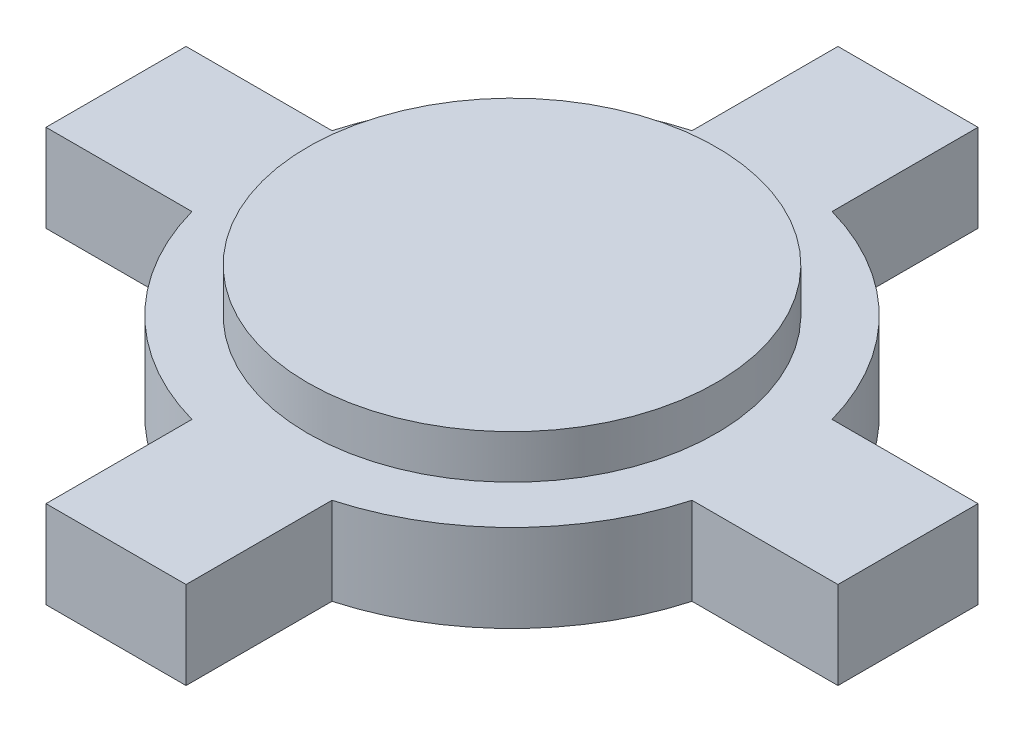
ISO-10303-21;
HEADER;
FILE_DESCRIPTION(('STEP AP214'),'2;1');
FILE_NAME('part.step','',(''),(''),'','','');
FILE_SCHEMA(('AUTOMOTIVE_DESIGN { 1 0 10303 214 1 1 1 1 }'));
ENDSEC;
DATA;
#1=APPLICATION_CONTEXT('core data for automotive mechanical design processes');
#2=APPLICATION_PROTOCOL_DEFINITION('international standard','automotive_design',2000,#1);
#3=PRODUCT_CONTEXT('',#1,'mechanical');
#4=PRODUCT('Part','Part','',(#3));
#5=PRODUCT_RELATED_PRODUCT_CATEGORY('part','',(#4));
#6=PRODUCT_DEFINITION_FORMATION('','',#4);
#7=PRODUCT_DEFINITION_CONTEXT('part definition',#1,'design');
#8=PRODUCT_DEFINITION('design','',#6,#7);
#9=PRODUCT_DEFINITION_SHAPE('','',#8);
#10=(LENGTH_UNIT() NAMED_UNIT(*) SI_UNIT(.MILLI.,.METRE.));
#11=(NAMED_UNIT(*) PLANE_ANGLE_UNIT() SI_UNIT($,.RADIAN.));
#12=(NAMED_UNIT(*) SI_UNIT($,.STERADIAN.) SOLID_ANGLE_UNIT());
#13=UNCERTAINTY_MEASURE_WITH_UNIT(LENGTH_MEASURE(1.E-05),#10,'distance_accuracy_value','');
#14=(GEOMETRIC_REPRESENTATION_CONTEXT(3) GLOBAL_UNCERTAINTY_ASSIGNED_CONTEXT((#13)) GLOBAL_UNIT_ASSIGNED_CONTEXT((#10,
#11,#12)) REPRESENTATION_CONTEXT('',''));
#15=CARTESIAN_POINT('',(0.,0.,0.));
#16=DIRECTION('',(0.,0.,1.));
#17=DIRECTION('',(1.,0.,0.));
#18=AXIS2_PLACEMENT_3D('',#15,#16,#17);
#19=CARTESIAN_POINT('',(-13.5702975444263,3.,-2.4));
#20=DIRECTION('',(1.,0.,0.));
#21=DIRECTION('',(0.,0.,-1.));
#22=AXIS2_PLACEMENT_3D('',#19,#20,#21);
#23=PLANE('',#22);
#24=DIRECTION('',(0.,0.,1.));
#25=VECTOR('',#24,1.);
#26=CARTESIAN_POINT('',(-13.5702975444263,0.,-2.4));
#27=LINE('',#26,#25);
#28=CARTESIAN_POINT('',(-13.5702975444263,0.,-2.4));
#29=VERTEX_POINT('',#28);
#30=CARTESIAN_POINT('',(-13.5702975444263,0.,2.4));
#31=VERTEX_POINT('',#30);
#32=EDGE_CURVE('E187',#29,#31,#27,.T.);
#33=ORIENTED_EDGE('',*,*,#32,.T.);
#34=DIRECTION('',(0.,-1.,0.));
#35=VECTOR('',#34,1.);
#36=CARTESIAN_POINT('',(-13.5702975444263,3.,2.4));
#37=LINE('',#36,#35);
#38=CARTESIAN_POINT('',(-13.5702975444263,3.,2.4));
#39=VERTEX_POINT('',#38);
#40=EDGE_CURVE('E44',#39,#31,#37,.T.);
#41=ORIENTED_EDGE('',*,*,#40,.F.);
#42=DIRECTION('',(0.,0.,1.));
#43=VECTOR('',#42,1.);
#44=CARTESIAN_POINT('',(-13.5702975444263,3.,-2.4));
#45=LINE('',#44,#43);
#46=CARTESIAN_POINT('',(-13.5702975444263,3.,-2.4));
#47=VERTEX_POINT('',#46);
#48=EDGE_CURVE('E218',#47,#39,#45,.T.);
#49=ORIENTED_EDGE('',*,*,#48,.F.);
#50=DIRECTION('',(0.,-1.,0.));
#51=VECTOR('',#50,1.);
#52=CARTESIAN_POINT('',(-13.5702975444263,3.,-2.4));
#53=LINE('',#52,#51);
#54=EDGE_CURVE('E183',#47,#29,#53,.T.);
#55=ORIENTED_EDGE('',*,*,#54,.T.);
#56=EDGE_LOOP('',(#33,#41,#49,#55));
#57=FACE_BOUND('',#56,.T.);
#58=ADVANCED_FACE('F41',(#57),#23,.F.);
#59=CARTESIAN_POINT('',(-13.5702975444263,3.,2.4));
#60=DIRECTION('',(0.,0.,-1.));
#61=DIRECTION('',(-1.,0.,0.));
#62=AXIS2_PLACEMENT_3D('',#59,#60,#61);
#63=PLANE('',#62);
#64=DIRECTION('',(1.,0.,0.));
#65=VECTOR('',#64,1.);
#66=CARTESIAN_POINT('',(-13.5702975444263,0.,2.4));
#67=LINE('',#66,#65);
#68=CARTESIAN_POINT('',(-8.57029754442633,0.,2.4));
#69=VERTEX_POINT('',#68);
#70=EDGE_CURVE('E190',#31,#69,#67,.T.);
#71=ORIENTED_EDGE('',*,*,#70,.T.);
#72=DIRECTION('',(0.,-1.,0.));
#73=VECTOR('',#72,1.);
#74=CARTESIAN_POINT('',(-8.57029754442633,3.,2.4));
#75=LINE('',#74,#73);
#76=CARTESIAN_POINT('',(-8.57029754442633,3.,2.4));
#77=VERTEX_POINT('',#76);
#78=EDGE_CURVE('E251',#77,#69,#75,.T.);
#79=ORIENTED_EDGE('',*,*,#78,.F.);
#80=DIRECTION('',(1.,0.,0.));
#81=VECTOR('',#80,1.);
#82=CARTESIAN_POINT('',(-13.5702975444263,3.,2.4));
#83=LINE('',#82,#81);
#84=EDGE_CURVE('E126',#39,#77,#83,.T.);
#85=ORIENTED_EDGE('',*,*,#84,.F.);
#86=ORIENTED_EDGE('',*,*,#40,.T.);
#87=EDGE_LOOP('',(#71,#79,#85,#86));
#88=FACE_BOUND('',#87,.T.);
#89=ADVANCED_FACE('F257',(#88),#63,.F.);
#90=CARTESIAN_POINT('',(0.,3.,0.));
#91=DIRECTION('',(0.,-1.,0.));
#92=DIRECTION('',(0.,0.,-1.));
#93=AXIS2_PLACEMENT_3D('',#90,#91,#92);
#94=CYLINDRICAL_SURFACE('',#93,8.9);
#95=CARTESIAN_POINT('',(0.,0.,0.));
#96=DIRECTION('',(0.,1.,0.));
#97=DIRECTION('',(0.,0.,1.));
#98=AXIS2_PLACEMENT_3D('',#95,#96,#97);
#99=CIRCLE('',#98,8.9);
#100=CARTESIAN_POINT('',(-2.39999999999999,0.,8.57029754442633));
#101=VERTEX_POINT('',#100);
#102=EDGE_CURVE('E193',#69,#101,#99,.T.);
#103=ORIENTED_EDGE('',*,*,#102,.T.);
#104=DIRECTION('',(0.,-1.,0.));
#105=VECTOR('',#104,1.);
#106=CARTESIAN_POINT('',(-2.39999999999999,3.,8.57029754442633));
#107=LINE('',#106,#105);
#108=CARTESIAN_POINT('',(-2.39999999999999,3.,8.57029754442633));
#109=VERTEX_POINT('',#108);
#110=EDGE_CURVE('E249',#109,#101,#107,.T.);
#111=ORIENTED_EDGE('',*,*,#110,.F.);
#112=CARTESIAN_POINT('',(0.,3.,0.));
#113=DIRECTION('',(0.,1.,0.));
#114=DIRECTION('',(0.,0.,1.));
#115=AXIS2_PLACEMENT_3D('',#112,#113,#114);
#116=CIRCLE('',#115,8.9);
#117=EDGE_CURVE('E274',#77,#109,#116,.T.);
#118=ORIENTED_EDGE('',*,*,#117,.F.);
#119=ORIENTED_EDGE('',*,*,#78,.T.);
#120=EDGE_LOOP('',(#103,#111,#118,#119));
#121=FACE_BOUND('',#120,.T.);
#122=ADVANCED_FACE('F266',(#121),#94,.T.);
#123=CARTESIAN_POINT('',(-2.39999999999999,3.,8.57029754442633));
#124=DIRECTION('',(1.,0.,0.));
#125=DIRECTION('',(0.,0.,-1.));
#126=AXIS2_PLACEMENT_3D('',#123,#124,#125);
#127=PLANE('',#126);
#128=DIRECTION('',(0.,0.,1.));
#129=VECTOR('',#128,1.);
#130=CARTESIAN_POINT('',(-2.39999999999999,0.,8.57029754442633));
#131=LINE('',#130,#129);
#132=CARTESIAN_POINT('',(-2.4,0.,13.5702975444263));
#133=VERTEX_POINT('',#132);
#134=EDGE_CURVE('E195',#101,#133,#131,.T.);
#135=ORIENTED_EDGE('',*,*,#134,.T.);
#136=DIRECTION('',(0.,-1.,0.));
#137=VECTOR('',#136,1.);
#138=CARTESIAN_POINT('',(-2.4,3.,13.5702975444263));
#139=LINE('',#138,#137);
#140=CARTESIAN_POINT('',(-2.4,3.,13.5702975444263));
#141=VERTEX_POINT('',#140);
#142=EDGE_CURVE('E246',#141,#133,#139,.T.);
#143=ORIENTED_EDGE('',*,*,#142,.F.);
#144=DIRECTION('',(0.,0.,1.));
#145=VECTOR('',#144,1.);
#146=CARTESIAN_POINT('',(-2.39999999999999,3.,8.57029754442633));
#147=LINE('',#146,#145);
#148=EDGE_CURVE('E271',#109,#141,#147,.T.);
#149=ORIENTED_EDGE('',*,*,#148,.F.);
#150=ORIENTED_EDGE('',*,*,#110,.T.);
#151=EDGE_LOOP('',(#135,#143,#149,#150));
#152=FACE_BOUND('',#151,.T.);
#153=ADVANCED_FACE('F269',(#152),#127,.F.);
#154=CARTESIAN_POINT('',(-2.4,3.,13.5702975444263));
#155=DIRECTION('',(0.,0.,-1.));
#156=DIRECTION('',(-1.,0.,0.));
#157=AXIS2_PLACEMENT_3D('',#154,#155,#156);
#158=PLANE('',#157);
#159=DIRECTION('',(1.,0.,0.));
#160=VECTOR('',#159,1.);
#161=CARTESIAN_POINT('',(-2.4,0.,13.5702975444263));
#162=LINE('',#161,#160);
#163=CARTESIAN_POINT('',(2.4,0.,13.5702975444263));
#164=VERTEX_POINT('',#163);
#165=EDGE_CURVE('E197',#133,#164,#162,.T.);
#166=ORIENTED_EDGE('',*,*,#165,.T.);
#167=DIRECTION('',(0.,-1.,0.));
#168=VECTOR('',#167,1.);
#169=CARTESIAN_POINT('',(2.4,3.,13.5702975444263));
#170=LINE('',#169,#168);
#171=CARTESIAN_POINT('',(2.4,3.,13.5702975444263));
#172=VERTEX_POINT('',#171);
#173=EDGE_CURVE('E243',#172,#164,#170,.T.);
#174=ORIENTED_EDGE('',*,*,#173,.F.);
#175=DIRECTION('',(1.,0.,0.));
#176=VECTOR('',#175,1.);
#177=CARTESIAN_POINT('',(-2.4,3.,13.5702975444263));
#178=LINE('',#177,#176);
#179=EDGE_CURVE('E273',#141,#172,#178,.T.);
#180=ORIENTED_EDGE('',*,*,#179,.F.);
#181=ORIENTED_EDGE('',*,*,#142,.T.);
#182=EDGE_LOOP('',(#166,#174,#180,#181));
#183=FACE_BOUND('',#182,.T.);
#184=ADVANCED_FACE('F333',(#183),#158,.F.);
#185=CARTESIAN_POINT('',(2.39999999999999,3.,8.57029754442633));
#186=DIRECTION('',(-1.,0.,0.));
#187=DIRECTION('',(0.,0.,1.));
#188=AXIS2_PLACEMENT_3D('',#185,#186,#187);
#189=PLANE('',#188);
#190=DIRECTION('',(0.,0.,-1.));
#191=VECTOR('',#190,1.);
#192=CARTESIAN_POINT('',(2.39999999999999,0.,8.57029754442633));
#193=LINE('',#192,#191);
#194=CARTESIAN_POINT('',(2.39999999999999,0.,8.57029754442633));
#195=VERTEX_POINT('',#194);
#196=EDGE_CURVE('E199',#164,#195,#193,.T.);
#197=ORIENTED_EDGE('',*,*,#196,.T.);
#198=DIRECTION('',(0.,-1.,0.));
#199=VECTOR('',#198,1.);
#200=CARTESIAN_POINT('',(2.39999999999999,3.,8.57029754442633));
#201=LINE('',#200,#199);
#202=CARTESIAN_POINT('',(2.39999999999999,3.,8.57029754442633));
#203=VERTEX_POINT('',#202);
#204=EDGE_CURVE('E240',#203,#195,#201,.T.);
#205=ORIENTED_EDGE('',*,*,#204,.F.);
#206=DIRECTION('',(0.,0.,-1.));
#207=VECTOR('',#206,1.);
#208=CARTESIAN_POINT('',(2.39999999999999,3.,8.57029754442633));
#209=LINE('',#208,#207);
#210=EDGE_CURVE('E276',#172,#203,#209,.T.);
#211=ORIENTED_EDGE('',*,*,#210,.F.);
#212=ORIENTED_EDGE('',*,*,#173,.T.);
#213=EDGE_LOOP('',(#197,#205,#211,#212));
#214=FACE_BOUND('',#213,.T.);
#215=ADVANCED_FACE('F330',(#214),#189,.F.);
#216=CARTESIAN_POINT('',(0.,3.,0.));
#217=DIRECTION('',(0.,-1.,0.));
#218=DIRECTION('',(0.,0.,-1.));
#219=AXIS2_PLACEMENT_3D('',#216,#217,#218);
#220=CYLINDRICAL_SURFACE('',#219,8.9);
#221=CARTESIAN_POINT('',(0.,0.,0.));
#222=DIRECTION('',(0.,1.,0.));
#223=DIRECTION('',(0.,0.,1.));
#224=AXIS2_PLACEMENT_3D('',#221,#222,#223);
#225=CIRCLE('',#224,8.9);
#226=CARTESIAN_POINT('',(8.57029754442633,0.,2.4));
#227=VERTEX_POINT('',#226);
#228=EDGE_CURVE('E201',#195,#227,#225,.T.);
#229=ORIENTED_EDGE('',*,*,#228,.T.);
#230=DIRECTION('',(0.,-1.,0.));
#231=VECTOR('',#230,1.);
#232=CARTESIAN_POINT('',(8.57029754442633,3.,2.4));
#233=LINE('',#232,#231);
#234=CARTESIAN_POINT('',(8.57029754442633,3.,2.4));
#235=VERTEX_POINT('',#234);
#236=EDGE_CURVE('E237',#235,#227,#233,.T.);
#237=ORIENTED_EDGE('',*,*,#236,.F.);
#238=CARTESIAN_POINT('',(0.,3.,0.));
#239=DIRECTION('',(0.,1.,0.));
#240=DIRECTION('',(0.,0.,1.));
#241=AXIS2_PLACEMENT_3D('',#238,#239,#240);
#242=CIRCLE('',#241,8.9);
#243=EDGE_CURVE('E282',#203,#235,#242,.T.);
#244=ORIENTED_EDGE('',*,*,#243,.F.);
#245=ORIENTED_EDGE('',*,*,#204,.T.);
#246=EDGE_LOOP('',(#229,#237,#244,#245));
#247=FACE_BOUND('',#246,.T.);
#248=ADVANCED_FACE('F326',(#247),#220,.T.);
#249=CARTESIAN_POINT('',(8.57029754442633,3.,2.4));
#250=DIRECTION('',(0.,0.,-1.));
#251=DIRECTION('',(-1.,0.,0.));
#252=AXIS2_PLACEMENT_3D('',#249,#250,#251);
#253=PLANE('',#252);
#254=DIRECTION('',(1.,0.,0.));
#255=VECTOR('',#254,1.);
#256=CARTESIAN_POINT('',(8.57029754442633,0.,2.4));
#257=LINE('',#256,#255);
#258=CARTESIAN_POINT('',(13.5702975444263,0.,2.4));
#259=VERTEX_POINT('',#258);
#260=EDGE_CURVE('E203',#227,#259,#257,.T.);
#261=ORIENTED_EDGE('',*,*,#260,.T.);
#262=DIRECTION('',(0.,-1.,0.));
#263=VECTOR('',#262,1.);
#264=CARTESIAN_POINT('',(13.5702975444263,3.,2.4));
#265=LINE('',#264,#263);
#266=CARTESIAN_POINT('',(13.5702975444263,3.,2.4));
#267=VERTEX_POINT('',#266);
#268=EDGE_CURVE('E234',#267,#259,#265,.T.);
#269=ORIENTED_EDGE('',*,*,#268,.F.);
#270=DIRECTION('',(1.,0.,0.));
#271=VECTOR('',#270,1.);
#272=CARTESIAN_POINT('',(8.57029754442633,3.,2.4));
#273=LINE('',#272,#271);
#274=EDGE_CURVE('E284',#235,#267,#273,.T.);
#275=ORIENTED_EDGE('',*,*,#274,.F.);
#276=ORIENTED_EDGE('',*,*,#236,.T.);
#277=EDGE_LOOP('',(#261,#269,#275,#276));
#278=FACE_BOUND('',#277,.T.);
#279=ADVANCED_FACE('F321',(#278),#253,.F.);
#280=CARTESIAN_POINT('',(13.5702975444263,3.,-2.4));
#281=DIRECTION('',(-1.,0.,0.));
#282=DIRECTION('',(0.,0.,1.));
#283=AXIS2_PLACEMENT_3D('',#280,#281,#282);
#284=PLANE('',#283);
#285=DIRECTION('',(0.,0.,-1.));
#286=VECTOR('',#285,1.);
#287=CARTESIAN_POINT('',(13.5702975444263,0.,-2.4));
#288=LINE('',#287,#286);
#289=CARTESIAN_POINT('',(13.5702975444263,0.,-2.4));
#290=VERTEX_POINT('',#289);
#291=EDGE_CURVE('E205',#259,#290,#288,.T.);
#292=ORIENTED_EDGE('',*,*,#291,.T.);
#293=DIRECTION('',(0.,-1.,0.));
#294=VECTOR('',#293,1.);
#295=CARTESIAN_POINT('',(13.5702975444263,3.,-2.4));
#296=LINE('',#295,#294);
#297=CARTESIAN_POINT('',(13.5702975444263,3.,-2.4));
#298=VERTEX_POINT('',#297);
#299=EDGE_CURVE('E231',#298,#290,#296,.T.);
#300=ORIENTED_EDGE('',*,*,#299,.F.);
#301=DIRECTION('',(0.,0.,-1.));
#302=VECTOR('',#301,1.);
#303=CARTESIAN_POINT('',(13.5702975444263,3.,-2.4));
#304=LINE('',#303,#302);
#305=EDGE_CURVE('E286',#267,#298,#304,.T.);
#306=ORIENTED_EDGE('',*,*,#305,.F.);
#307=ORIENTED_EDGE('',*,*,#268,.T.);
#308=EDGE_LOOP('',(#292,#300,#306,#307));
#309=FACE_BOUND('',#308,.T.);
#310=ADVANCED_FACE('F315',(#309),#284,.F.);
#311=CARTESIAN_POINT('',(8.57029754442633,3.,-2.4));
#312=DIRECTION('',(0.,0.,1.));
#313=DIRECTION('',(1.,0.,0.));
#314=AXIS2_PLACEMENT_3D('',#311,#312,#313);
#315=PLANE('',#314);
#316=DIRECTION('',(-1.,0.,0.));
#317=VECTOR('',#316,1.);
#318=CARTESIAN_POINT('',(8.57029754442633,0.,-2.4));
#319=LINE('',#318,#317);
#320=CARTESIAN_POINT('',(8.57029754442633,0.,-2.4));
#321=VERTEX_POINT('',#320);
#322=EDGE_CURVE('E207',#290,#321,#319,.T.);
#323=ORIENTED_EDGE('',*,*,#322,.T.);
#324=DIRECTION('',(0.,-1.,0.));
#325=VECTOR('',#324,1.);
#326=CARTESIAN_POINT('',(8.57029754442633,3.,-2.4));
#327=LINE('',#326,#325);
#328=CARTESIAN_POINT('',(8.57029754442633,3.,-2.4));
#329=VERTEX_POINT('',#328);
#330=EDGE_CURVE('E228',#329,#321,#327,.T.);
#331=ORIENTED_EDGE('',*,*,#330,.F.);
#332=DIRECTION('',(-1.,0.,0.));
#333=VECTOR('',#332,1.);
#334=CARTESIAN_POINT('',(8.57029754442633,3.,-2.4));
#335=LINE('',#334,#333);
#336=EDGE_CURVE('E288',#298,#329,#335,.T.);
#337=ORIENTED_EDGE('',*,*,#336,.F.);
#338=ORIENTED_EDGE('',*,*,#299,.T.);
#339=EDGE_LOOP('',(#323,#331,#337,#338));
#340=FACE_BOUND('',#339,.T.);
#341=ADVANCED_FACE('F311',(#340),#315,.F.);
#342=CARTESIAN_POINT('',(0.,3.,0.));
#343=DIRECTION('',(0.,-1.,0.));
#344=DIRECTION('',(0.,0.,-1.));
#345=AXIS2_PLACEMENT_3D('',#342,#343,#344);
#346=CYLINDRICAL_SURFACE('',#345,8.9);
#347=CARTESIAN_POINT('',(0.,0.,0.));
#348=DIRECTION('',(0.,1.,0.));
#349=DIRECTION('',(0.,0.,1.));
#350=AXIS2_PLACEMENT_3D('',#347,#348,#349);
#351=CIRCLE('',#350,8.9);
#352=CARTESIAN_POINT('',(2.4,0.,-8.57029754442633));
#353=VERTEX_POINT('',#352);
#354=EDGE_CURVE('E209',#321,#353,#351,.T.);
#355=ORIENTED_EDGE('',*,*,#354,.T.);
#356=DIRECTION('',(0.,-1.,0.));
#357=VECTOR('',#356,1.);
#358=CARTESIAN_POINT('',(2.4,3.,-8.57029754442633));
#359=LINE('',#358,#357);
#360=CARTESIAN_POINT('',(2.4,3.,-8.57029754442633));
#361=VERTEX_POINT('',#360);
#362=EDGE_CURVE('E225',#361,#353,#359,.T.);
#363=ORIENTED_EDGE('',*,*,#362,.F.);
#364=CARTESIAN_POINT('',(0.,3.,0.));
#365=DIRECTION('',(0.,1.,0.));
#366=DIRECTION('',(0.,0.,1.));
#367=AXIS2_PLACEMENT_3D('',#364,#365,#366);
#368=CIRCLE('',#367,8.9);
#369=EDGE_CURVE('E290',#329,#361,#368,.T.);
#370=ORIENTED_EDGE('',*,*,#369,.F.);
#371=ORIENTED_EDGE('',*,*,#330,.T.);
#372=EDGE_LOOP('',(#355,#363,#370,#371));
#373=FACE_BOUND('',#372,.T.);
#374=ADVANCED_FACE('F307',(#373),#346,.T.);
#375=CARTESIAN_POINT('',(2.4,3.,-13.5702975444263));
#376=DIRECTION('',(-1.,0.,0.));
#377=DIRECTION('',(0.,0.,1.));
#378=AXIS2_PLACEMENT_3D('',#375,#376,#377);
#379=PLANE('',#378);
#380=DIRECTION('',(0.,0.,-1.));
#381=VECTOR('',#380,1.);
#382=CARTESIAN_POINT('',(2.4,0.,-13.5702975444263));
#383=LINE('',#382,#381);
#384=CARTESIAN_POINT('',(2.4,0.,-13.5702975444263));
#385=VERTEX_POINT('',#384);
#386=EDGE_CURVE('E211',#353,#385,#383,.T.);
#387=ORIENTED_EDGE('',*,*,#386,.T.);
#388=DIRECTION('',(0.,-1.,0.));
#389=VECTOR('',#388,1.);
#390=CARTESIAN_POINT('',(2.4,3.,-13.5702975444263));
#391=LINE('',#390,#389);
#392=CARTESIAN_POINT('',(2.4,3.,-13.5702975444263));
#393=VERTEX_POINT('',#392);
#394=EDGE_CURVE('E222',#393,#385,#391,.T.);
#395=ORIENTED_EDGE('',*,*,#394,.F.);
#396=DIRECTION('',(0.,0.,-1.));
#397=VECTOR('',#396,1.);
#398=CARTESIAN_POINT('',(2.4,3.,-13.5702975444263));
#399=LINE('',#398,#397);
#400=EDGE_CURVE('E292',#361,#393,#399,.T.);
#401=ORIENTED_EDGE('',*,*,#400,.F.);
#402=ORIENTED_EDGE('',*,*,#362,.T.);
#403=EDGE_LOOP('',(#387,#395,#401,#402));
#404=FACE_BOUND('',#403,.T.);
#405=ADVANCED_FACE('F298',(#404),#379,.F.);
#406=CARTESIAN_POINT('',(-2.4,3.,-13.5702975444263));
#407=DIRECTION('',(0.,0.,1.));
#408=DIRECTION('',(1.,0.,0.));
#409=AXIS2_PLACEMENT_3D('',#406,#407,#408);
#410=PLANE('',#409);
#411=DIRECTION('',(-1.,0.,0.));
#412=VECTOR('',#411,1.);
#413=CARTESIAN_POINT('',(-2.4,0.,-13.5702975444263));
#414=LINE('',#413,#412);
#415=CARTESIAN_POINT('',(-2.4,0.,-13.5702975444263));
#416=VERTEX_POINT('',#415);
#417=EDGE_CURVE('E213',#385,#416,#414,.T.);
#418=ORIENTED_EDGE('',*,*,#417,.T.);
#419=DIRECTION('',(0.,-1.,0.));
#420=VECTOR('',#419,1.);
#421=CARTESIAN_POINT('',(-2.4,3.,-13.5702975444263));
#422=LINE('',#421,#420);
#423=CARTESIAN_POINT('',(-2.4,3.,-13.5702975444263));
#424=VERTEX_POINT('',#423);
#425=EDGE_CURVE('E178',#424,#416,#422,.T.);
#426=ORIENTED_EDGE('',*,*,#425,.F.);
#427=DIRECTION('',(-1.,0.,0.));
#428=VECTOR('',#427,1.);
#429=CARTESIAN_POINT('',(-2.4,3.,-13.5702975444263));
#430=LINE('',#429,#428);
#431=EDGE_CURVE('E169',#393,#424,#430,.T.);
#432=ORIENTED_EDGE('',*,*,#431,.F.);
#433=ORIENTED_EDGE('',*,*,#394,.T.);
#434=EDGE_LOOP('',(#418,#426,#432,#433));
#435=FACE_BOUND('',#434,.T.);
#436=ADVANCED_FACE('F302',(#435),#410,.F.);
#437=CARTESIAN_POINT('',(-2.4,3.,-13.5702975444263));
#438=DIRECTION('',(1.,0.,0.));
#439=DIRECTION('',(0.,0.,-1.));
#440=AXIS2_PLACEMENT_3D('',#437,#438,#439);
#441=PLANE('',#440);
#442=DIRECTION('',(0.,0.,1.));
#443=VECTOR('',#442,1.);
#444=CARTESIAN_POINT('',(-2.4,0.,-13.5702975444263));
#445=LINE('',#444,#443);
#446=CARTESIAN_POINT('',(-2.4,0.,-8.57029754442633));
#447=VERTEX_POINT('',#446);
#448=EDGE_CURVE('E177',#416,#447,#445,.T.);
#449=ORIENTED_EDGE('',*,*,#448,.T.);
#450=DIRECTION('',(0.,-1.,0.));
#451=VECTOR('',#450,1.);
#452=CARTESIAN_POINT('',(-2.4,3.,-8.57029754442633));
#453=LINE('',#452,#451);
#454=CARTESIAN_POINT('',(-2.4,3.,-8.57029754442633));
#455=VERTEX_POINT('',#454);
#456=EDGE_CURVE('E174',#455,#447,#453,.T.);
#457=ORIENTED_EDGE('',*,*,#456,.F.);
#458=DIRECTION('',(0.,0.,1.));
#459=VECTOR('',#458,1.);
#460=CARTESIAN_POINT('',(-2.4,3.,-13.5702975444263));
#461=LINE('',#460,#459);
#462=EDGE_CURVE('E163',#424,#455,#461,.T.);
#463=ORIENTED_EDGE('',*,*,#462,.F.);
#464=ORIENTED_EDGE('',*,*,#425,.T.);
#465=EDGE_LOOP('',(#449,#457,#463,#464));
#466=FACE_BOUND('',#465,.T.);
#467=ADVANCED_FACE('F175',(#466),#441,.F.);
#468=CARTESIAN_POINT('',(0.,3.,0.));
#469=DIRECTION('',(0.,-1.,0.));
#470=DIRECTION('',(0.,0.,-1.));
#471=AXIS2_PLACEMENT_3D('',#468,#469,#470);
#472=CYLINDRICAL_SURFACE('',#471,8.9);
#473=CARTESIAN_POINT('',(0.,0.,0.));
#474=DIRECTION('',(0.,1.,0.));
#475=DIRECTION('',(0.,0.,1.));
#476=AXIS2_PLACEMENT_3D('',#473,#474,#475);
#477=CIRCLE('',#476,8.9);
#478=CARTESIAN_POINT('',(-8.57029754442633,0.,-2.4));
#479=VERTEX_POINT('',#478);
#480=EDGE_CURVE('E111',#447,#479,#477,.T.);
#481=ORIENTED_EDGE('',*,*,#480,.T.);
#482=DIRECTION('',(0.,-1.,0.));
#483=VECTOR('',#482,1.);
#484=CARTESIAN_POINT('',(-8.57029754442633,3.,-2.4));
#485=LINE('',#484,#483);
#486=CARTESIAN_POINT('',(-8.57029754442633,3.,-2.4));
#487=VERTEX_POINT('',#486);
#488=EDGE_CURVE('E179',#487,#479,#485,.T.);
#489=ORIENTED_EDGE('',*,*,#488,.F.);
#490=CARTESIAN_POINT('',(0.,3.,0.));
#491=DIRECTION('',(0.,1.,0.));
#492=DIRECTION('',(0.,0.,1.));
#493=AXIS2_PLACEMENT_3D('',#490,#491,#492);
#494=CIRCLE('',#493,8.9);
#495=EDGE_CURVE('E167',#455,#487,#494,.T.);
#496=ORIENTED_EDGE('',*,*,#495,.F.);
#497=ORIENTED_EDGE('',*,*,#456,.T.);
#498=EDGE_LOOP('',(#481,#489,#496,#497));
#499=FACE_BOUND('',#498,.T.);
#500=ADVANCED_FACE('F181',(#499),#472,.T.);
#501=CARTESIAN_POINT('',(-13.5702975444263,3.,-2.4));
#502=DIRECTION('',(0.,0.,1.));
#503=DIRECTION('',(1.,0.,0.));
#504=AXIS2_PLACEMENT_3D('',#501,#502,#503);
#505=PLANE('',#504);
#506=DIRECTION('',(-1.,0.,0.));
#507=VECTOR('',#506,1.);
#508=CARTESIAN_POINT('',(-13.5702975444263,0.,-2.4));
#509=LINE('',#508,#507);
#510=EDGE_CURVE('E117',#479,#29,#509,.T.);
#511=ORIENTED_EDGE('',*,*,#510,.T.);
#512=ORIENTED_EDGE('',*,*,#54,.F.);
#513=DIRECTION('',(-1.,0.,0.));
#514=VECTOR('',#513,1.);
#515=CARTESIAN_POINT('',(-13.5702975444263,3.,-2.4));
#516=LINE('',#515,#514);
#517=EDGE_CURVE('E58',#487,#47,#516,.T.);
#518=ORIENTED_EDGE('',*,*,#517,.F.);
#519=ORIENTED_EDGE('',*,*,#488,.T.);
#520=EDGE_LOOP('',(#511,#512,#518,#519));
#521=FACE_BOUND('',#520,.T.);
#522=ADVANCED_FACE('F417',(#521),#505,.F.);
#523=CARTESIAN_POINT('',(0.,3.,0.));
#524=DIRECTION('',(0.,1.,0.));
#525=DIRECTION('',(0.,0.,1.));
#526=AXIS2_PLACEMENT_3D('',#523,#524,#525);
#527=PLANE('',#526);
#528=CARTESIAN_POINT('',(0.,3.,0.));
#529=DIRECTION('',(0.,1.,0.));
#530=DIRECTION('',(0.,0.,1.));
#531=AXIS2_PLACEMENT_3D('',#528,#529,#530);
#532=CIRCLE('',#531,7.);
#533=CARTESIAN_POINT('',(0.,3.,7.));
#534=VERTEX_POINT('',#533);
#535=EDGE_CURVE('E11',#534,#534,#532,.T.);
#536=ORIENTED_EDGE('',*,*,#535,.F.);
#537=EDGE_LOOP('',(#536));
#538=FACE_BOUND('',#537,.T.);
#539=ORIENTED_EDGE('',*,*,#48,.T.);
#540=ORIENTED_EDGE('',*,*,#84,.T.);
#541=ORIENTED_EDGE('',*,*,#117,.T.);
#542=ORIENTED_EDGE('',*,*,#148,.T.);
#543=ORIENTED_EDGE('',*,*,#179,.T.);
#544=ORIENTED_EDGE('',*,*,#210,.T.);
#545=ORIENTED_EDGE('',*,*,#243,.T.);
#546=ORIENTED_EDGE('',*,*,#274,.T.);
#547=ORIENTED_EDGE('',*,*,#305,.T.);
#548=ORIENTED_EDGE('',*,*,#336,.T.);
#549=ORIENTED_EDGE('',*,*,#369,.T.);
#550=ORIENTED_EDGE('',*,*,#400,.T.);
#551=ORIENTED_EDGE('',*,*,#431,.T.);
#552=ORIENTED_EDGE('',*,*,#462,.T.);
#553=ORIENTED_EDGE('',*,*,#495,.T.);
#554=ORIENTED_EDGE('',*,*,#517,.T.);
#555=EDGE_LOOP('',(#539,#540,#541,#542,#543,#544,#545,#546,#547,#548,#549,#550,#551,#552,#553,#554));
#556=FACE_BOUND('',#555,.T.);
#557=ADVANCED_FACE('F165',(#538,#556),#527,.T.);
#558=CARTESIAN_POINT('',(0.,0.,0.));
#559=DIRECTION('',(0.,1.,0.));
#560=DIRECTION('',(0.,0.,1.));
#561=AXIS2_PLACEMENT_3D('',#558,#559,#560);
#562=PLANE('',#561);
#563=ORIENTED_EDGE('',*,*,#32,.F.);
#564=ORIENTED_EDGE('',*,*,#510,.F.);
#565=ORIENTED_EDGE('',*,*,#480,.F.);
#566=ORIENTED_EDGE('',*,*,#448,.F.);
#567=ORIENTED_EDGE('',*,*,#417,.F.);
#568=ORIENTED_EDGE('',*,*,#386,.F.);
#569=ORIENTED_EDGE('',*,*,#354,.F.);
#570=ORIENTED_EDGE('',*,*,#322,.F.);
#571=ORIENTED_EDGE('',*,*,#291,.F.);
#572=ORIENTED_EDGE('',*,*,#260,.F.);
#573=ORIENTED_EDGE('',*,*,#228,.F.);
#574=ORIENTED_EDGE('',*,*,#196,.F.);
#575=ORIENTED_EDGE('',*,*,#165,.F.);
#576=ORIENTED_EDGE('',*,*,#134,.F.);
#577=ORIENTED_EDGE('',*,*,#102,.F.);
#578=ORIENTED_EDGE('',*,*,#70,.F.);
#579=EDGE_LOOP('',(#563,#564,#565,#566,#567,#568,#569,#570,#571,#572,#573,#574,#575,#576,#577,#578));
#580=FACE_BOUND('',#579,.T.);
#581=ADVANCED_FACE('F262',(#580),#562,.F.);
#582=CARTESIAN_POINT('',(0.,4.5,0.));
#583=DIRECTION('',(0.,-1.,0.));
#584=DIRECTION('',(0.,0.,-1.));
#585=AXIS2_PLACEMENT_3D('',#582,#583,#584);
#586=CYLINDRICAL_SURFACE('',#585,7.);
#587=CARTESIAN_POINT('',(0.,4.5,0.));
#588=DIRECTION('',(0.,1.,0.));
#589=DIRECTION('',(0.,0.,1.));
#590=AXIS2_PLACEMENT_3D('',#587,#588,#589);
#591=CIRCLE('',#590,7.);
#592=CARTESIAN_POINT('',(0.,4.5,7.));
#593=VERTEX_POINT('',#592);
#594=EDGE_CURVE('E191',#593,#593,#591,.T.);
#595=ORIENTED_EDGE('',*,*,#594,.F.);
#596=EDGE_LOOP('',(#595));
#597=FACE_BOUND('',#596,.T.);
#598=ORIENTED_EDGE('',*,*,#535,.T.);
#599=EDGE_LOOP('',(#598));
#600=FACE_BOUND('',#599,.T.);
#601=ADVANCED_FACE('F438',(#597,#600),#586,.T.);
#602=CARTESIAN_POINT('',(0.,4.5,0.));
#603=DIRECTION('',(0.,1.,0.));
#604=DIRECTION('',(0.,0.,1.));
#605=AXIS2_PLACEMENT_3D('',#602,#603,#604);
#606=PLANE('',#605);
#607=ORIENTED_EDGE('',*,*,#594,.T.);
#608=EDGE_LOOP('',(#607));
#609=FACE_BOUND('',#608,.T.);
#610=ADVANCED_FACE('F445',(#609),#606,.T.);
#611=CLOSED_SHELL('',(#58,#89,#122,#153,#184,#215,#248,#279,#310,#341,#374,#405,#436,#467,#500,
#522,#557,#581,#601,#610));
#612=MANIFOLD_SOLID_BREP('B2',#611);
#613=ADVANCED_BREP_SHAPE_REPRESENTATION('',(#18,#612),#14);
#614=SHAPE_DEFINITION_REPRESENTATION(#9,#613);
ENDSEC;
END-ISO-10303-21;
